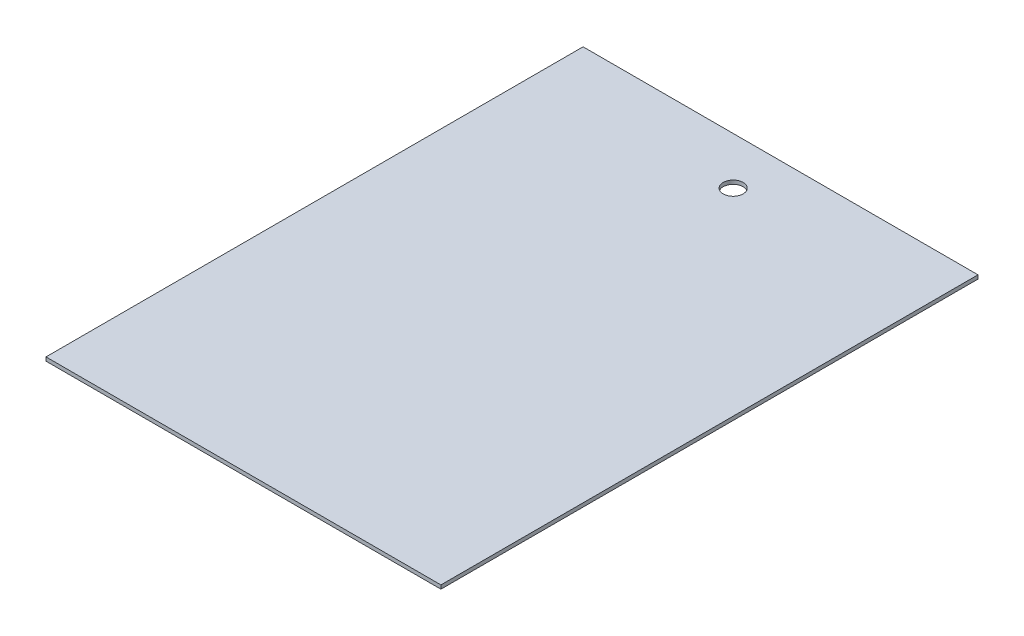
ISO-10303-21;
HEADER;
FILE_DESCRIPTION(('STEP AP214'),'2;1');
FILE_NAME('part.step','',(''),(''),'','','');
FILE_SCHEMA(('AUTOMOTIVE_DESIGN { 1 0 10303 214 1 1 1 1 }'));
ENDSEC;
DATA;
#1=APPLICATION_CONTEXT('core data for automotive mechanical design processes');
#2=APPLICATION_PROTOCOL_DEFINITION('international standard','automotive_design',2000,#1);
#3=PRODUCT_CONTEXT('',#1,'mechanical');
#4=PRODUCT('Part','Part','',(#3));
#5=PRODUCT_RELATED_PRODUCT_CATEGORY('part','',(#4));
#6=PRODUCT_DEFINITION_FORMATION('','',#4);
#7=PRODUCT_DEFINITION_CONTEXT('part definition',#1,'design');
#8=PRODUCT_DEFINITION('design','',#6,#7);
#9=PRODUCT_DEFINITION_SHAPE('','',#8);
#10=(LENGTH_UNIT() NAMED_UNIT(*) SI_UNIT(.MILLI.,.METRE.));
#11=(NAMED_UNIT(*) PLANE_ANGLE_UNIT() SI_UNIT($,.RADIAN.));
#12=(NAMED_UNIT(*) SI_UNIT($,.STERADIAN.) SOLID_ANGLE_UNIT());
#13=UNCERTAINTY_MEASURE_WITH_UNIT(LENGTH_MEASURE(1.E-05),#10,'distance_accuracy_value','');
#14=(GEOMETRIC_REPRESENTATION_CONTEXT(3) GLOBAL_UNCERTAINTY_ASSIGNED_CONTEXT((#13)) GLOBAL_UNIT_ASSIGNED_CONTEXT((#10,
#11,#12)) REPRESENTATION_CONTEXT('',''));
#15=CARTESIAN_POINT('',(0.,0.,0.));
#16=DIRECTION('',(0.,0.,1.));
#17=DIRECTION('',(1.,0.,0.));
#18=AXIS2_PLACEMENT_3D('',#15,#16,#17);
#19=CARTESIAN_POINT('',(158.75,3.,-215.9));
#20=DIRECTION('',(-1.,0.,0.));
#21=DIRECTION('',(0.,0.,1.));
#22=AXIS2_PLACEMENT_3D('',#19,#20,#21);
#23=PLANE('',#22);
#24=DIRECTION('',(0.,0.,-1.));
#25=VECTOR('',#24,1.);
#26=CARTESIAN_POINT('',(158.75,0.,-215.9));
#27=LINE('',#26,#25);
#28=CARTESIAN_POINT('',(158.75,0.,215.9));
#29=VERTEX_POINT('',#28);
#30=CARTESIAN_POINT('',(158.75,0.,-215.9));
#31=VERTEX_POINT('',#30);
#32=EDGE_CURVE('E96',#29,#31,#27,.T.);
#33=ORIENTED_EDGE('',*,*,#32,.T.);
#34=DIRECTION('',(0.,-1.,0.));
#35=VECTOR('',#34,1.);
#36=CARTESIAN_POINT('',(158.75,3.,-215.9));
#37=LINE('',#36,#35);
#38=CARTESIAN_POINT('',(158.75,3.,-215.9));
#39=VERTEX_POINT('',#38);
#40=EDGE_CURVE('E11',#39,#31,#37,.T.);
#41=ORIENTED_EDGE('',*,*,#40,.F.);
#42=DIRECTION('',(0.,0.,-1.));
#43=VECTOR('',#42,1.);
#44=CARTESIAN_POINT('',(158.75,3.,-215.9));
#45=LINE('',#44,#43);
#46=CARTESIAN_POINT('',(158.75,3.,215.9));
#47=VERTEX_POINT('',#46);
#48=EDGE_CURVE('E84',#47,#39,#45,.T.);
#49=ORIENTED_EDGE('',*,*,#48,.F.);
#50=DIRECTION('',(0.,-1.,0.));
#51=VECTOR('',#50,1.);
#52=CARTESIAN_POINT('',(158.75,3.,215.9));
#53=LINE('',#52,#51);
#54=EDGE_CURVE('E92',#47,#29,#53,.T.);
#55=ORIENTED_EDGE('',*,*,#54,.T.);
#56=EDGE_LOOP('',(#33,#41,#49,#55));
#57=FACE_BOUND('',#56,.T.);
#58=ADVANCED_FACE('F33',(#57),#23,.F.);
#59=CARTESIAN_POINT('',(-158.75,3.,-215.9));
#60=DIRECTION('',(0.,0.,1.));
#61=DIRECTION('',(1.,0.,0.));
#62=AXIS2_PLACEMENT_3D('',#59,#60,#61);
#63=PLANE('',#62);
#64=DIRECTION('',(-1.,0.,0.));
#65=VECTOR('',#64,1.);
#66=CARTESIAN_POINT('',(-158.75,0.,-215.9));
#67=LINE('',#66,#65);
#68=CARTESIAN_POINT('',(-158.75,0.,-215.9));
#69=VERTEX_POINT('',#68);
#70=EDGE_CURVE('E88',#31,#69,#67,.T.);
#71=ORIENTED_EDGE('',*,*,#70,.T.);
#72=DIRECTION('',(0.,-1.,0.));
#73=VECTOR('',#72,1.);
#74=CARTESIAN_POINT('',(-158.75,3.,-215.9));
#75=LINE('',#74,#73);
#76=CARTESIAN_POINT('',(-158.75,3.,-215.9));
#77=VERTEX_POINT('',#76);
#78=EDGE_CURVE('E41',#77,#69,#75,.T.);
#79=ORIENTED_EDGE('',*,*,#78,.F.);
#80=DIRECTION('',(-1.,0.,0.));
#81=VECTOR('',#80,1.);
#82=CARTESIAN_POINT('',(-158.75,3.,-215.9));
#83=LINE('',#82,#81);
#84=EDGE_CURVE('E79',#39,#77,#83,.T.);
#85=ORIENTED_EDGE('',*,*,#84,.F.);
#86=ORIENTED_EDGE('',*,*,#40,.T.);
#87=EDGE_LOOP('',(#71,#79,#85,#86));
#88=FACE_BOUND('',#87,.T.);
#89=ADVANCED_FACE('F87',(#88),#63,.F.);
#90=CARTESIAN_POINT('',(-158.75,3.,-215.9));
#91=DIRECTION('',(1.,0.,0.));
#92=DIRECTION('',(0.,0.,-1.));
#93=AXIS2_PLACEMENT_3D('',#90,#91,#92);
#94=PLANE('',#93);
#95=DIRECTION('',(0.,0.,1.));
#96=VECTOR('',#95,1.);
#97=CARTESIAN_POINT('',(-158.75,0.,-215.9));
#98=LINE('',#97,#96);
#99=CARTESIAN_POINT('',(-158.75,0.,215.9));
#100=VERTEX_POINT('',#99);
#101=EDGE_CURVE('E66',#69,#100,#98,.T.);
#102=ORIENTED_EDGE('',*,*,#101,.T.);
#103=DIRECTION('',(0.,-1.,0.));
#104=VECTOR('',#103,1.);
#105=CARTESIAN_POINT('',(-158.75,3.,215.9));
#106=LINE('',#105,#104);
#107=CARTESIAN_POINT('',(-158.75,3.,215.9));
#108=VERTEX_POINT('',#107);
#109=EDGE_CURVE('E89',#108,#100,#106,.T.);
#110=ORIENTED_EDGE('',*,*,#109,.F.);
#111=DIRECTION('',(0.,0.,1.));
#112=VECTOR('',#111,1.);
#113=CARTESIAN_POINT('',(-158.75,3.,-215.9));
#114=LINE('',#113,#112);
#115=EDGE_CURVE('E82',#77,#108,#114,.T.);
#116=ORIENTED_EDGE('',*,*,#115,.F.);
#117=ORIENTED_EDGE('',*,*,#78,.T.);
#118=EDGE_LOOP('',(#102,#110,#116,#117));
#119=FACE_BOUND('',#118,.T.);
#120=ADVANCED_FACE('F90',(#119),#94,.F.);
#121=CARTESIAN_POINT('',(-158.75,3.,215.9));
#122=DIRECTION('',(0.,0.,-1.));
#123=DIRECTION('',(-1.,0.,0.));
#124=AXIS2_PLACEMENT_3D('',#121,#122,#123);
#125=PLANE('',#124);
#126=DIRECTION('',(1.,0.,0.));
#127=VECTOR('',#126,1.);
#128=CARTESIAN_POINT('',(-158.75,0.,215.9));
#129=LINE('',#128,#127);
#130=EDGE_CURVE('E72',#100,#29,#129,.T.);
#131=ORIENTED_EDGE('',*,*,#130,.T.);
#132=ORIENTED_EDGE('',*,*,#54,.F.);
#133=DIRECTION('',(1.,0.,0.));
#134=VECTOR('',#133,1.);
#135=CARTESIAN_POINT('',(-158.75,3.,215.9));
#136=LINE('',#135,#134);
#137=EDGE_CURVE('E49',#108,#47,#136,.T.);
#138=ORIENTED_EDGE('',*,*,#137,.F.);
#139=ORIENTED_EDGE('',*,*,#109,.T.);
#140=EDGE_LOOP('',(#131,#132,#138,#139));
#141=FACE_BOUND('',#140,.T.);
#142=ADVANCED_FACE('F104',(#141),#125,.F.);
#143=CARTESIAN_POINT('',(0.,3.,0.));
#144=DIRECTION('',(0.,1.,0.));
#145=DIRECTION('',(0.,0.,1.));
#146=AXIS2_PLACEMENT_3D('',#143,#144,#145);
#147=PLANE('',#146);
#148=CARTESIAN_POINT('',(0.,3.,-177.8));
#149=DIRECTION('',(0.,1.,0.));
#150=DIRECTION('',(0.,0.,1.));
#151=AXIS2_PLACEMENT_3D('',#148,#149,#150);
#152=CIRCLE('',#151,8.00000000000001);
#153=CARTESIAN_POINT('',(0.,3.,-169.8));
#154=VERTEX_POINT('',#153);
#155=EDGE_CURVE('E110',#154,#154,#152,.T.);
#156=ORIENTED_EDGE('',*,*,#155,.F.);
#157=EDGE_LOOP('',(#156));
#158=FACE_BOUND('',#157,.T.);
#159=ORIENTED_EDGE('',*,*,#48,.T.);
#160=ORIENTED_EDGE('',*,*,#84,.T.);
#161=ORIENTED_EDGE('',*,*,#115,.T.);
#162=ORIENTED_EDGE('',*,*,#137,.T.);
#163=EDGE_LOOP('',(#159,#160,#161,#162));
#164=FACE_BOUND('',#163,.T.);
#165=ADVANCED_FACE('F80',(#158,#164),#147,.T.);
#166=CARTESIAN_POINT('',(0.,0.,0.));
#167=DIRECTION('',(0.,1.,0.));
#168=DIRECTION('',(0.,0.,1.));
#169=AXIS2_PLACEMENT_3D('',#166,#167,#168);
#170=PLANE('',#169);
#171=CARTESIAN_POINT('',(0.,0.,-177.8));
#172=DIRECTION('',(0.,1.,0.));
#173=DIRECTION('',(0.,0.,1.));
#174=AXIS2_PLACEMENT_3D('',#171,#172,#173);
#175=CIRCLE('',#174,8.00000000000001);
#176=CARTESIAN_POINT('',(0.,0.,-169.8));
#177=VERTEX_POINT('',#176);
#178=EDGE_CURVE('E99',#177,#177,#175,.T.);
#179=ORIENTED_EDGE('',*,*,#178,.T.);
#180=EDGE_LOOP('',(#179));
#181=FACE_BOUND('',#180,.T.);
#182=ORIENTED_EDGE('',*,*,#32,.F.);
#183=ORIENTED_EDGE('',*,*,#130,.F.);
#184=ORIENTED_EDGE('',*,*,#101,.F.);
#185=ORIENTED_EDGE('',*,*,#70,.F.);
#186=EDGE_LOOP('',(#182,#183,#184,#185));
#187=FACE_BOUND('',#186,.T.);
#188=ADVANCED_FACE('F107',(#181,#187),#170,.F.);
#189=CARTESIAN_POINT('',(0.,0.,-177.8));
#190=DIRECTION('',(0.,1.,0.));
#191=DIRECTION('',(0.,0.,1.));
#192=AXIS2_PLACEMENT_3D('',#189,#190,#191);
#193=CYLINDRICAL_SURFACE('',#192,8.00000000000001);
#194=ORIENTED_EDGE('',*,*,#178,.F.);
#195=EDGE_LOOP('',(#194));
#196=FACE_BOUND('',#195,.T.);
#197=ORIENTED_EDGE('',*,*,#155,.T.);
#198=EDGE_LOOP('',(#197));
#199=FACE_BOUND('',#198,.T.);
#200=ADVANCED_FACE('F117',(#196,#199),#193,.F.);
#201=CLOSED_SHELL('',(#58,#89,#120,#142,#165,#188,#200));
#202=MANIFOLD_SOLID_BREP('B2',#201);
#203=ADVANCED_BREP_SHAPE_REPRESENTATION('',(#18,#202),#14);
#204=SHAPE_DEFINITION_REPRESENTATION(#9,#203);
ENDSEC;
END-ISO-10303-21;
